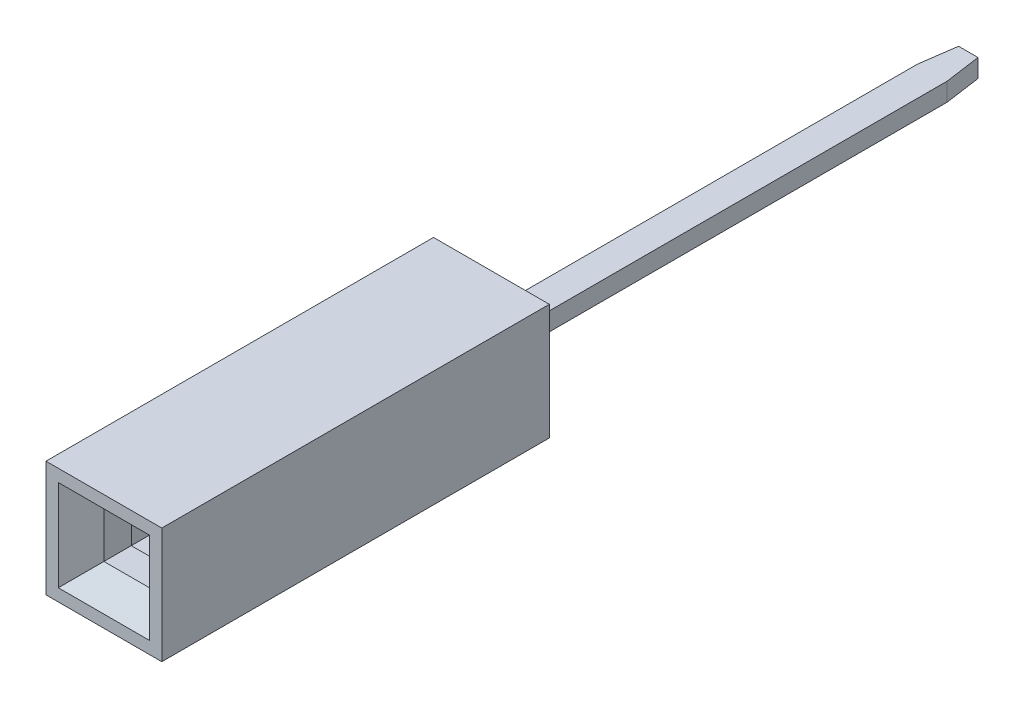
ISO-10303-21;
HEADER;
FILE_DESCRIPTION(('STEP AP214'),'2;1');
FILE_NAME('part.step','',(''),(''),'','','');
FILE_SCHEMA(('AUTOMOTIVE_DESIGN { 1 0 10303 214 1 1 1 1 }'));
ENDSEC;
DATA;
#1=APPLICATION_CONTEXT('core data for automotive mechanical design processes');
#2=APPLICATION_PROTOCOL_DEFINITION('international standard','automotive_design',2000,#1);
#3=PRODUCT_CONTEXT('',#1,'mechanical');
#4=PRODUCT('Part','Part','',(#3));
#5=PRODUCT_RELATED_PRODUCT_CATEGORY('part','',(#4));
#6=PRODUCT_DEFINITION_FORMATION('','',#4);
#7=PRODUCT_DEFINITION_CONTEXT('part definition',#1,'design');
#8=PRODUCT_DEFINITION('design','',#6,#7);
#9=PRODUCT_DEFINITION_SHAPE('','',#8);
#10=(LENGTH_UNIT() NAMED_UNIT(*) SI_UNIT(.MILLI.,.METRE.));
#11=(NAMED_UNIT(*) PLANE_ANGLE_UNIT() SI_UNIT($,.RADIAN.));
#12=(NAMED_UNIT(*) SI_UNIT($,.STERADIAN.) SOLID_ANGLE_UNIT());
#13=UNCERTAINTY_MEASURE_WITH_UNIT(LENGTH_MEASURE(1.E-05),#10,'distance_accuracy_value','');
#14=(GEOMETRIC_REPRESENTATION_CONTEXT(3) GLOBAL_UNCERTAINTY_ASSIGNED_CONTEXT((#13)) GLOBAL_UNIT_ASSIGNED_CONTEXT((#10,
#11,#12)) REPRESENTATION_CONTEXT('',''));
#15=CARTESIAN_POINT('',(0.,0.,0.));
#16=DIRECTION('',(0.,0.,1.));
#17=DIRECTION('',(1.,0.,0.));
#18=AXIS2_PLACEMENT_3D('',#15,#16,#17);
#19=CARTESIAN_POINT('',(0.,0.2,0.284306438184069));
#20=DIRECTION('',(0.,1.,0.));
#21=DIRECTION('',(-1.,0.,0.));
#22=AXIS2_PLACEMENT_3D('',#19,#20,#21);
#23=PLANE('',#22);
#24=DIRECTION('',(0.395545502562963,0.,0.918446381343088));
#25=VECTOR('',#24,1.);
#26=CARTESIAN_POINT('',(0.725635995876159,0.2,7.6218292408588));
#27=LINE('',#26,#25);
#28=CARTESIAN_POINT('',(0.850958820007971,0.2,7.91282558281629));
#29=VERTEX_POINT('',#28);
#30=CARTESIAN_POINT('',(0.600313171744347,0.2,7.33083289890131));
#31=VERTEX_POINT('',#30);
#32=EDGE_CURVE('P0_E245',#29,#31,#27,.F.);
#33=ORIENTED_EDGE('',*,*,#32,.F.);
#34=CARTESIAN_POINT('',(0.942803458142281,0.2,7.87327103255999));
#35=DIRECTION('',(0.,1.,0.));
#36=DIRECTION('',(0.,0.,1.));
#37=AXIS2_PLACEMENT_3D('',#34,#35,#36);
#38=CIRCLE('',#37,0.100000000000002);
#39=CARTESIAN_POINT('',(1.04280345814228,0.2,7.87327103255999));
#40=VERTEX_POINT('',#39);
#41=EDGE_CURVE('P0_E292',#40,#29,#38,.F.);
#42=ORIENTED_EDGE('',*,*,#41,.F.);
#43=DIRECTION('',(0.,0.,-1.));
#44=VECTOR('',#43,1.);
#45=CARTESIAN_POINT('',(1.04280345814228,0.2,4.38077744066125));
#46=LINE('',#45,#44);
#47=CARTESIAN_POINT('',(1.04280345814228,0.2,0.888283848762512));
#48=VERTEX_POINT('',#47);
#49=EDGE_CURVE('P0_E236',#48,#40,#46,.F.);
#50=ORIENTED_EDGE('',*,*,#49,.F.);
#51=DIRECTION('',(-1.,0.,0.));
#52=VECTOR('',#51,1.);
#53=CARTESIAN_POINT('',(0.,0.2,0.888283848762512));
#54=LINE('',#53,#52);
#55=CARTESIAN_POINT('',(0.324469626937749,0.2,0.888283848762512));
#56=VERTEX_POINT('',#55);
#57=EDGE_CURVE('P0_E233',#48,#56,#54,.T.);
#58=ORIENTED_EDGE('',*,*,#57,.T.);
#59=DIRECTION('',(0.,0.,-1.));
#60=VECTOR('',#59,1.);
#61=CARTESIAN_POINT('',(0.324469626937749,0.2,-4.39155100923728));
#62=LINE('',#61,#60);
#63=CARTESIAN_POINT('',(0.324469626937751,0.2,-9.67138586723707));
#64=VERTEX_POINT('',#63);
#65=EDGE_CURVE('P0_E230',#64,#56,#62,.F.);
#66=ORIENTED_EDGE('',*,*,#65,.F.);
#67=DIRECTION('',(-0.14003721977104,0.,-0.990146240248781));
#68=VECTOR('',#67,1.);
#69=CARTESIAN_POINT('',(0.268734813468875,0.2,-10.0654640708561));
#70=LINE('',#69,#68);
#71=CARTESIAN_POINT('',(0.213000000000001,0.2,-10.4595422744751));
#72=VERTEX_POINT('',#71);
#73=EDGE_CURVE('P0_E218',#72,#64,#70,.F.);
#74=ORIENTED_EDGE('',*,*,#73,.F.);
#75=DIRECTION('',(-1.,0.,0.));
#76=VECTOR('',#75,1.);
#77=CARTESIAN_POINT('',(0.1065,0.2,-10.4595422744751));
#78=LINE('',#77,#76);
#79=CARTESIAN_POINT('',(-0.213000000000003,0.2,-10.4595422744751));
#80=VERTEX_POINT('',#79);
#81=EDGE_CURVE('P0_E208',#80,#72,#78,.F.);
#82=ORIENTED_EDGE('',*,*,#81,.F.);
#83=DIRECTION('',(-0.14003721977104,0.,0.990146240248781));
#84=VECTOR('',#83,1.);
#85=CARTESIAN_POINT('',(-0.268734813468875,0.2,-10.0654640708561));
#86=LINE('',#85,#84);
#87=CARTESIAN_POINT('',(-0.32446962693775,0.2,-9.67138586723707));
#88=VERTEX_POINT('',#87);
#89=EDGE_CURVE('P0_E198',#88,#80,#86,.F.);
#90=ORIENTED_EDGE('',*,*,#89,.F.);
#91=DIRECTION('',(0.,0.,1.));
#92=VECTOR('',#91,1.);
#93=CARTESIAN_POINT('',(-0.324469626937749,0.2,-4.39155100923728));
#94=LINE('',#93,#92);
#95=CARTESIAN_POINT('',(-0.324469626937749,0.2,0.888283848762512));
#96=VERTEX_POINT('',#95);
#97=EDGE_CURVE('P0_E188',#96,#88,#94,.F.);
#98=ORIENTED_EDGE('',*,*,#97,.F.);
#99=DIRECTION('',(-1.,0.,0.));
#100=VECTOR('',#99,1.);
#101=CARTESIAN_POINT('',(-0.683636542540015,0.2,0.888283848762512));
#102=LINE('',#101,#100);
#103=CARTESIAN_POINT('',(-1.04280345814228,0.2,0.888283848762512));
#104=VERTEX_POINT('',#103);
#105=EDGE_CURVE('P0_E155',#104,#96,#102,.F.);
#106=ORIENTED_EDGE('',*,*,#105,.F.);
#107=DIRECTION('',(0.,0.,1.));
#108=VECTOR('',#107,1.);
#109=CARTESIAN_POINT('',(-1.04280345814228,0.2,4.38077744066125));
#110=LINE('',#109,#108);
#111=CARTESIAN_POINT('',(-1.04280345814228,0.2,7.87327103255999));
#112=VERTEX_POINT('',#111);
#113=EDGE_CURVE('P0_E152',#112,#104,#110,.F.);
#114=ORIENTED_EDGE('',*,*,#113,.F.);
#115=CARTESIAN_POINT('',(-0.942803458142281,0.2,7.87327103255999));
#116=DIRECTION('',(0.,1.,0.));
#117=DIRECTION('',(0.,0.,1.));
#118=AXIS2_PLACEMENT_3D('',#115,#116,#117);
#119=CIRCLE('',#118,0.099999999999999);
#120=CARTESIAN_POINT('',(-0.850958820007972,0.2,7.91282558281629));
#121=VERTEX_POINT('',#120);
#122=EDGE_CURVE('P0_E20',#121,#112,#119,.F.);
#123=ORIENTED_EDGE('',*,*,#122,.F.);
#124=DIRECTION('',(0.395545502562963,0.,-0.918446381343088));
#125=VECTOR('',#124,1.);
#126=CARTESIAN_POINT('',(-0.72563599587616,0.2,7.6218292408588));
#127=LINE('',#126,#125);
#128=CARTESIAN_POINT('',(-0.600313171744342,0.2,7.3308328989013));
#129=VERTEX_POINT('',#128);
#130=EDGE_CURVE('P0_E137',#129,#121,#127,.F.);
#131=ORIENTED_EDGE('',*,*,#130,.F.);
#132=CARTESIAN_POINT('',(-2.98279491669871,0.2,6.42995974435727));
#133=DIRECTION('',(0.,1.,0.));
#134=DIRECTION('',(0.,0.,1.));
#135=AXIS2_PLACEMENT_3D('',#132,#133,#134);
#136=CIRCLE('',#135,2.54711438801223);
#137=CARTESIAN_POINT('',(-0.600313171744347,0.2,5.52908658981323));
#138=VERTEX_POINT('',#137);
#139=EDGE_CURVE('P0_E298',#138,#129,#136,.F.);
#140=ORIENTED_EDGE('',*,*,#139,.F.);
#141=DIRECTION('',(0.,0.,-1.));
#142=VECTOR('',#141,1.);
#143=CARTESIAN_POINT('',(-0.600313171744347,0.2,4.10337653011083));
#144=LINE('',#143,#142);
#145=CARTESIAN_POINT('',(-0.600313171744348,0.2,2.67766647040844));
#146=VERTEX_POINT('',#145);
#147=EDGE_CURVE('P0_E253',#146,#138,#144,.F.);
#148=ORIENTED_EDGE('',*,*,#147,.F.);
#149=CARTESIAN_POINT('',(0.,0.2,2.67766647040844));
#150=DIRECTION('',(0.,1.,0.));
#151=DIRECTION('',(0.,0.,1.));
#152=AXIS2_PLACEMENT_3D('',#149,#150,#151);
#153=CIRCLE('',#152,0.60031317174435);
#154=CARTESIAN_POINT('',(0.600313171744347,0.2,2.67766647040844));
#155=VERTEX_POINT('',#154);
#156=EDGE_CURVE('P0_E252',#146,#155,#153,.F.);
#157=ORIENTED_EDGE('',*,*,#156,.T.);
#158=DIRECTION('',(0.,0.,1.));
#159=VECTOR('',#158,1.);
#160=CARTESIAN_POINT('',(0.600313171744347,0.2,4.10337653011083));
#161=LINE('',#160,#159);
#162=CARTESIAN_POINT('',(0.600313171744347,0.2,5.52908658981323));
#163=VERTEX_POINT('',#162);
#164=EDGE_CURVE('P0_E249',#163,#155,#161,.F.);
#165=ORIENTED_EDGE('',*,*,#164,.F.);
#166=CARTESIAN_POINT('',(2.98279491669871,0.2,6.42995974435727));
#167=DIRECTION('',(0.,1.,0.));
#168=DIRECTION('',(0.,0.,1.));
#169=AXIS2_PLACEMENT_3D('',#166,#167,#168);
#170=CIRCLE('',#169,2.54711438801223);
#171=EDGE_CURVE('P0_E294',#31,#163,#170,.F.);
#172=ORIENTED_EDGE('',*,*,#171,.F.);
#173=EDGE_LOOP('',(#33,#42,#50,#58,#66,#74,#82,#90,#98,#106,#114,#123,#131,#140,#148,#157,#165,#172));
#174=FACE_BOUND('',#173,.T.);
#175=ADVANCED_FACE('P0_F17',(#174),#23,.T.);
#176=CARTESIAN_POINT('',(0.324469626937749,-0.2,-4.39155100923728));
#177=DIRECTION('',(1.,0.,0.));
#178=DIRECTION('',(0.,0.,-1.));
#179=AXIS2_PLACEMENT_3D('',#176,#177,#178);
#180=PLANE('',#179);
#181=DIRECTION('',(0.,0.,1.));
#182=VECTOR('',#181,1.);
#183=CARTESIAN_POINT('',(0.324469626937749,-0.2,0.284306438184069));
#184=LINE('',#183,#182);
#185=CARTESIAN_POINT('',(0.324469626937749,-0.2,0.888283848762512));
#186=VERTEX_POINT('',#185);
#187=CARTESIAN_POINT('',(0.324469626937757,-0.2,-9.67138586723696));
#188=VERTEX_POINT('',#187);
#189=EDGE_CURVE('P0_E213',#186,#188,#184,.F.);
#190=ORIENTED_EDGE('',*,*,#189,.T.);
#191=DIRECTION('',(0.,1.,0.));
#192=VECTOR('',#191,1.);
#193=CARTESIAN_POINT('',(0.324469626937751,-0.2,-9.67138586723707));
#194=LINE('',#193,#192);
#195=EDGE_CURVE('P0_E216',#64,#188,#194,.F.);
#196=ORIENTED_EDGE('',*,*,#195,.F.);
#197=ORIENTED_EDGE('',*,*,#65,.T.);
#198=DIRECTION('',(0.,1.,0.));
#199=VECTOR('',#198,1.);
#200=CARTESIAN_POINT('',(0.324469626937749,-0.2,0.888283848762512));
#201=LINE('',#200,#199);
#202=EDGE_CURVE('P0_E223',#186,#56,#201,.T.);
#203=ORIENTED_EDGE('',*,*,#202,.F.);
#204=EDGE_LOOP('',(#190,#196,#197,#203));
#205=FACE_BOUND('',#204,.T.);
#206=ADVANCED_FACE('P0_F403',(#205),#180,.T.);
#207=CARTESIAN_POINT('',(0.268734813468875,-0.2,-10.0654640708561));
#208=DIRECTION('',(0.990146240248781,0.,-0.14003721977104));
#209=DIRECTION('',(-0.14003721977104,0.,-0.990146240248781));
#210=AXIS2_PLACEMENT_3D('',#207,#208,#209);
#211=PLANE('',#210);
#212=DIRECTION('',(-0.140037219771042,0.,-0.990146240248781));
#213=VECTOR('',#212,1.);
#214=CARTESIAN_POINT('',(0.324469626937749,-0.2,-9.67138586723707));
#215=LINE('',#214,#213);
#216=CARTESIAN_POINT('',(0.213,-0.2,-10.4595422744751));
#217=VERTEX_POINT('',#216);
#218=EDGE_CURVE('P0_E203',#188,#217,#215,.T.);
#219=ORIENTED_EDGE('',*,*,#218,.T.);
#220=DIRECTION('',(0.,1.,0.));
#221=VECTOR('',#220,1.);
#222=CARTESIAN_POINT('',(0.213,-0.2,-10.4595422744751));
#223=LINE('',#222,#221);
#224=EDGE_CURVE('P0_E206',#72,#217,#223,.F.);
#225=ORIENTED_EDGE('',*,*,#224,.F.);
#226=ORIENTED_EDGE('',*,*,#73,.T.);
#227=ORIENTED_EDGE('',*,*,#195,.T.);
#228=EDGE_LOOP('',(#219,#225,#226,#227));
#229=FACE_BOUND('',#228,.T.);
#230=ADVANCED_FACE('P0_F409',(#229),#211,.T.);
#231=CARTESIAN_POINT('',(0.1065,-0.2,-10.4595422744751));
#232=DIRECTION('',(0.,0.,-1.));
#233=DIRECTION('',(-1.,0.,0.));
#234=AXIS2_PLACEMENT_3D('',#231,#232,#233);
#235=PLANE('',#234);
#236=DIRECTION('',(-1.,0.,0.));
#237=VECTOR('',#236,1.);
#238=CARTESIAN_POINT('',(0.,-0.2,-10.4595422744751));
#239=LINE('',#238,#237);
#240=CARTESIAN_POINT('',(-0.213000000000001,-0.2,-10.4595422744751));
#241=VERTEX_POINT('',#240);
#242=EDGE_CURVE('P0_E193',#217,#241,#239,.T.);
#243=ORIENTED_EDGE('',*,*,#242,.T.);
#244=DIRECTION('',(0.,1.,0.));
#245=VECTOR('',#244,1.);
#246=CARTESIAN_POINT('',(-0.213000000000003,-0.2,-10.4595422744751));
#247=LINE('',#246,#245);
#248=EDGE_CURVE('P0_E196',#80,#241,#247,.F.);
#249=ORIENTED_EDGE('',*,*,#248,.F.);
#250=ORIENTED_EDGE('',*,*,#81,.T.);
#251=ORIENTED_EDGE('',*,*,#224,.T.);
#252=EDGE_LOOP('',(#243,#249,#250,#251));
#253=FACE_BOUND('',#252,.T.);
#254=ADVANCED_FACE('P0_F415',(#253),#235,.T.);
#255=CARTESIAN_POINT('',(-0.268734813468875,-0.2,-10.0654640708561));
#256=DIRECTION('',(-0.990146240248781,0.,-0.14003721977104));
#257=DIRECTION('',(-0.14003721977104,0.,0.990146240248781));
#258=AXIS2_PLACEMENT_3D('',#255,#256,#257);
#259=PLANE('',#258);
#260=DIRECTION('',(-0.140037219771042,0.,0.990146240248781));
#261=VECTOR('',#260,1.);
#262=CARTESIAN_POINT('',(-0.213,-0.2,-10.4595422744751));
#263=LINE('',#262,#261);
#264=CARTESIAN_POINT('',(-0.324469626937747,-0.2,-9.67138586723709));
#265=VERTEX_POINT('',#264);
#266=EDGE_CURVE('P0_E183',#241,#265,#263,.T.);
#267=ORIENTED_EDGE('',*,*,#266,.T.);
#268=DIRECTION('',(0.,1.,0.));
#269=VECTOR('',#268,1.);
#270=CARTESIAN_POINT('',(-0.324469626937749,-0.2,-9.67138586723707));
#271=LINE('',#270,#269);
#272=EDGE_CURVE('P0_E186',#88,#265,#271,.F.);
#273=ORIENTED_EDGE('',*,*,#272,.F.);
#274=ORIENTED_EDGE('',*,*,#89,.T.);
#275=ORIENTED_EDGE('',*,*,#248,.T.);
#276=EDGE_LOOP('',(#267,#273,#274,#275));
#277=FACE_BOUND('',#276,.T.);
#278=ADVANCED_FACE('P0_F417',(#277),#259,.T.);
#279=CARTESIAN_POINT('',(-0.324469626937749,-0.2,-4.39155100923728));
#280=DIRECTION('',(-1.,0.,0.));
#281=DIRECTION('',(0.,0.,1.));
#282=AXIS2_PLACEMENT_3D('',#279,#280,#281);
#283=PLANE('',#282);
#284=DIRECTION('',(0.,0.,1.));
#285=VECTOR('',#284,1.);
#286=CARTESIAN_POINT('',(-0.324469626937749,-0.2,0.284306438184069));
#287=LINE('',#286,#285);
#288=CARTESIAN_POINT('',(-0.324469626937749,-0.2,0.888283848762512));
#289=VERTEX_POINT('',#288);
#290=EDGE_CURVE('P0_E175',#265,#289,#287,.T.);
#291=ORIENTED_EDGE('',*,*,#290,.T.);
#292=DIRECTION('',(0.,1.,0.));
#293=VECTOR('',#292,1.);
#294=CARTESIAN_POINT('',(-0.324469626937749,-0.2,0.888283848762512));
#295=LINE('',#294,#293);
#296=EDGE_CURVE('P0_E158',#96,#289,#295,.F.);
#297=ORIENTED_EDGE('',*,*,#296,.F.);
#298=ORIENTED_EDGE('',*,*,#97,.T.);
#299=ORIENTED_EDGE('',*,*,#272,.T.);
#300=EDGE_LOOP('',(#291,#297,#298,#299));
#301=FACE_BOUND('',#300,.T.);
#302=ADVANCED_FACE('P0_F422',(#301),#283,.T.);
#303=CARTESIAN_POINT('',(-0.683636542540015,-0.2,0.888283848762512));
#304=DIRECTION('',(0.,0.,-1.));
#305=DIRECTION('',(-1.,0.,0.));
#306=AXIS2_PLACEMENT_3D('',#303,#304,#305);
#307=PLANE('',#306);
#308=DIRECTION('',(-1.,0.,0.));
#309=VECTOR('',#308,1.);
#310=CARTESIAN_POINT('',(0.,-0.2,0.888283848762512));
#311=LINE('',#310,#309);
#312=CARTESIAN_POINT('',(-1.04280345814228,-0.2,0.888283848762512));
#313=VERTEX_POINT('',#312);
#314=EDGE_CURVE('P0_E172',#289,#313,#311,.T.);
#315=ORIENTED_EDGE('',*,*,#314,.T.);
#316=DIRECTION('',(0.,1.,0.));
#317=VECTOR('',#316,1.);
#318=CARTESIAN_POINT('',(-1.04280345814228,-0.2,0.888283848762512));
#319=LINE('',#318,#317);
#320=EDGE_CURVE('P0_E150',#104,#313,#319,.F.);
#321=ORIENTED_EDGE('',*,*,#320,.F.);
#322=ORIENTED_EDGE('',*,*,#105,.T.);
#323=ORIENTED_EDGE('',*,*,#296,.T.);
#324=EDGE_LOOP('',(#315,#321,#322,#323));
#325=FACE_BOUND('',#324,.T.);
#326=ADVANCED_FACE('P0_F424',(#325),#307,.T.);
#327=CARTESIAN_POINT('',(-1.04280345814228,-0.2,4.38077744066125));
#328=DIRECTION('',(-1.,0.,0.));
#329=DIRECTION('',(0.,0.,1.));
#330=AXIS2_PLACEMENT_3D('',#327,#328,#329);
#331=PLANE('',#330);
#332=DIRECTION('',(0.,0.,1.));
#333=VECTOR('',#332,1.);
#334=CARTESIAN_POINT('',(-1.04280345814228,-0.2,0.284306438184069));
#335=LINE('',#334,#333);
#336=CARTESIAN_POINT('',(-1.04280345814228,-0.2,7.87327103255999));
#337=VERTEX_POINT('',#336);
#338=EDGE_CURVE('P0_E163',#313,#337,#335,.T.);
#339=ORIENTED_EDGE('',*,*,#338,.T.);
#340=DIRECTION('',(0.,1.,0.));
#341=VECTOR('',#340,1.);
#342=CARTESIAN_POINT('',(-1.04280345814228,-0.2,7.87327103255999));
#343=LINE('',#342,#341);
#344=EDGE_CURVE('P0_E146',#112,#337,#343,.F.);
#345=ORIENTED_EDGE('',*,*,#344,.F.);
#346=ORIENTED_EDGE('',*,*,#113,.T.);
#347=ORIENTED_EDGE('',*,*,#320,.T.);
#348=EDGE_LOOP('',(#339,#345,#346,#347));
#349=FACE_BOUND('',#348,.T.);
#350=ADVANCED_FACE('P0_F161',(#349),#331,.T.);
#351=CARTESIAN_POINT('',(-0.942803458142281,-0.2,7.87327103255999));
#352=DIRECTION('',(0.,1.,0.));
#353=DIRECTION('',(0.,0.,1.));
#354=AXIS2_PLACEMENT_3D('',#351,#352,#353);
#355=CYLINDRICAL_SURFACE('',#354,0.099999999999999);
#356=CARTESIAN_POINT('',(-0.942803458142281,-0.2,7.87327103255999));
#357=DIRECTION('',(0.,1.,0.));
#358=DIRECTION('',(0.,0.,1.));
#359=AXIS2_PLACEMENT_3D('',#356,#357,#358);
#360=CIRCLE('',#359,0.099999999999999);
#361=CARTESIAN_POINT('',(-0.850958820007972,-0.2,7.91282558281629));
#362=VERTEX_POINT('',#361);
#363=EDGE_CURVE('P0_E290',#337,#362,#360,.T.);
#364=ORIENTED_EDGE('',*,*,#363,.T.);
#365=DIRECTION('',(0.,1.,0.));
#366=VECTOR('',#365,1.);
#367=CARTESIAN_POINT('',(-0.850958820007972,-0.2,7.91282558281629));
#368=LINE('',#367,#366);
#369=EDGE_CURVE('P0_E148',#121,#362,#368,.F.);
#370=ORIENTED_EDGE('',*,*,#369,.F.);
#371=ORIENTED_EDGE('',*,*,#122,.T.);
#372=ORIENTED_EDGE('',*,*,#344,.T.);
#373=EDGE_LOOP('',(#364,#370,#371,#372));
#374=FACE_BOUND('',#373,.T.);
#375=ADVANCED_FACE('P0_F144',(#374),#355,.T.);
#376=CARTESIAN_POINT('',(-0.72563599587616,-0.2,7.6218292408588));
#377=DIRECTION('',(0.918446381343088,0.,0.395545502562963));
#378=DIRECTION('',(0.395545502562963,0.,-0.918446381343088));
#379=AXIS2_PLACEMENT_3D('',#376,#377,#378);
#380=PLANE('',#379);
#381=DIRECTION('',(0.395545502562964,0.,-0.918446381343088));
#382=VECTOR('',#381,1.);
#383=CARTESIAN_POINT('',(-0.850958820007972,-0.2,7.91282558281629));
#384=LINE('',#383,#382);
#385=CARTESIAN_POINT('',(-0.600313171744348,-0.2,7.33083289890131));
#386=VERTEX_POINT('',#385);
#387=EDGE_CURVE('P0_E289',#362,#386,#384,.T.);
#388=ORIENTED_EDGE('',*,*,#387,.T.);
#389=DIRECTION('',(0.,1.,0.));
#390=VECTOR('',#389,1.);
#391=CARTESIAN_POINT('',(-0.600313171744347,-0.2,7.33083289890131));
#392=LINE('',#391,#390);
#393=EDGE_CURVE('P0_E255',#129,#386,#392,.F.);
#394=ORIENTED_EDGE('',*,*,#393,.F.);
#395=ORIENTED_EDGE('',*,*,#130,.T.);
#396=ORIENTED_EDGE('',*,*,#369,.T.);
#397=EDGE_LOOP('',(#388,#394,#395,#396));
#398=FACE_BOUND('',#397,.T.);
#399=ADVANCED_FACE('P0_F304',(#398),#380,.T.);
#400=CARTESIAN_POINT('',(-2.98279491669871,-0.2,6.42995974435727));
#401=DIRECTION('',(0.,1.,0.));
#402=DIRECTION('',(0.,0.,1.));
#403=AXIS2_PLACEMENT_3D('',#400,#401,#402);
#404=CYLINDRICAL_SURFACE('',#403,2.54711438801223);
#405=CARTESIAN_POINT('',(-2.98279491669871,-0.2,6.42995974435727));
#406=DIRECTION('',(0.,1.,0.));
#407=DIRECTION('',(0.,0.,1.));
#408=AXIS2_PLACEMENT_3D('',#405,#406,#407);
#409=CIRCLE('',#408,2.54711438801223);
#410=CARTESIAN_POINT('',(-0.600313171744347,-0.2,5.52908658981323));
#411=VERTEX_POINT('',#410);
#412=EDGE_CURVE('P0_E286',#386,#411,#409,.T.);
#413=ORIENTED_EDGE('',*,*,#412,.T.);
#414=DIRECTION('',(0.,1.,0.));
#415=VECTOR('',#414,1.);
#416=CARTESIAN_POINT('',(-0.600313171744347,-0.2,5.52908658981323));
#417=LINE('',#416,#415);
#418=EDGE_CURVE('P0_E254',#138,#411,#417,.F.);
#419=ORIENTED_EDGE('',*,*,#418,.F.);
#420=ORIENTED_EDGE('',*,*,#139,.T.);
#421=ORIENTED_EDGE('',*,*,#393,.T.);
#422=EDGE_LOOP('',(#413,#419,#420,#421));
#423=FACE_BOUND('',#422,.T.);
#424=ADVANCED_FACE('P0_F334',(#423),#404,.T.);
#425=CARTESIAN_POINT('',(-0.600313171744347,-0.2,4.10337653011083));
#426=DIRECTION('',(1.,0.,0.));
#427=DIRECTION('',(0.,0.,-1.));
#428=AXIS2_PLACEMENT_3D('',#425,#426,#427);
#429=PLANE('',#428);
#430=DIRECTION('',(0.,0.,1.));
#431=VECTOR('',#430,1.);
#432=CARTESIAN_POINT('',(-0.600313171744347,-0.2,0.284306438184069));
#433=LINE('',#432,#431);
#434=CARTESIAN_POINT('',(-0.600313171744348,-0.2,2.67766647040844));
#435=VERTEX_POINT('',#434);
#436=EDGE_CURVE('P0_E285',#411,#435,#433,.F.);
#437=ORIENTED_EDGE('',*,*,#436,.T.);
#438=DIRECTION('',(0.,1.,0.));
#439=VECTOR('',#438,1.);
#440=CARTESIAN_POINT('',(-0.60031317174435,-0.2,2.67766647040844));
#441=LINE('',#440,#439);
#442=EDGE_CURVE('P0_E297',#435,#146,#441,.T.);
#443=ORIENTED_EDGE('',*,*,#442,.T.);
#444=ORIENTED_EDGE('',*,*,#147,.T.);
#445=ORIENTED_EDGE('',*,*,#418,.T.);
#446=EDGE_LOOP('',(#437,#443,#444,#445));
#447=FACE_BOUND('',#446,.T.);
#448=ADVANCED_FACE('P0_F331',(#447),#429,.T.);
#449=CARTESIAN_POINT('',(0.,-0.2,2.67766647040844));
#450=DIRECTION('',(0.,1.,0.));
#451=DIRECTION('',(0.,0.,1.));
#452=AXIS2_PLACEMENT_3D('',#449,#450,#451);
#453=CYLINDRICAL_SURFACE('',#452,0.60031317174435);
#454=ORIENTED_EDGE('',*,*,#442,.F.);
#455=CARTESIAN_POINT('',(0.,-0.2,2.67766647040844));
#456=DIRECTION('',(0.,1.,0.));
#457=DIRECTION('',(0.,0.,1.));
#458=AXIS2_PLACEMENT_3D('',#455,#456,#457);
#459=CIRCLE('',#458,0.60031317174435);
#460=CARTESIAN_POINT('',(0.600313171744347,-0.2,2.67766647040844));
#461=VERTEX_POINT('',#460);
#462=EDGE_CURVE('P0_E282',#435,#461,#459,.F.);
#463=ORIENTED_EDGE('',*,*,#462,.T.);
#464=DIRECTION('',(0.,1.,0.));
#465=VECTOR('',#464,1.);
#466=CARTESIAN_POINT('',(0.600313171744347,-0.2,2.67766647040844));
#467=LINE('',#466,#465);
#468=EDGE_CURVE('P0_E251',#155,#461,#467,.F.);
#469=ORIENTED_EDGE('',*,*,#468,.F.);
#470=ORIENTED_EDGE('',*,*,#156,.F.);
#471=EDGE_LOOP('',(#454,#463,#469,#470));
#472=FACE_BOUND('',#471,.T.);
#473=ADVANCED_FACE('P0_F342',(#472),#453,.F.);
#474=CARTESIAN_POINT('',(0.600313171744347,-0.2,4.10337653011083));
#475=DIRECTION('',(-1.,0.,0.));
#476=DIRECTION('',(0.,0.,1.));
#477=AXIS2_PLACEMENT_3D('',#474,#475,#476);
#478=PLANE('',#477);
#479=DIRECTION('',(0.,0.,1.));
#480=VECTOR('',#479,1.);
#481=CARTESIAN_POINT('',(0.600313171744347,-0.2,0.284306438184069));
#482=LINE('',#481,#480);
#483=CARTESIAN_POINT('',(0.600313171744347,-0.2,5.52908658981323));
#484=VERTEX_POINT('',#483);
#485=EDGE_CURVE('P0_E281',#461,#484,#482,.T.);
#486=ORIENTED_EDGE('',*,*,#485,.T.);
#487=DIRECTION('',(0.,1.,0.));
#488=VECTOR('',#487,1.);
#489=CARTESIAN_POINT('',(0.600313171744347,-0.2,5.52908658981323));
#490=LINE('',#489,#488);
#491=EDGE_CURVE('P0_E248',#163,#484,#490,.F.);
#492=ORIENTED_EDGE('',*,*,#491,.F.);
#493=ORIENTED_EDGE('',*,*,#164,.T.);
#494=ORIENTED_EDGE('',*,*,#468,.T.);
#495=EDGE_LOOP('',(#486,#492,#493,#494));
#496=FACE_BOUND('',#495,.T.);
#497=ADVANCED_FACE('P0_F368',(#496),#478,.T.);
#498=CARTESIAN_POINT('',(2.98279491669871,-0.2,6.42995974435727));
#499=DIRECTION('',(0.,1.,0.));
#500=DIRECTION('',(0.,0.,1.));
#501=AXIS2_PLACEMENT_3D('',#498,#499,#500);
#502=CYLINDRICAL_SURFACE('',#501,2.54711438801223);
#503=CARTESIAN_POINT('',(2.98279491669871,-0.2,6.42995974435727));
#504=DIRECTION('',(0.,1.,0.));
#505=DIRECTION('',(0.,0.,1.));
#506=AXIS2_PLACEMENT_3D('',#503,#504,#505);
#507=CIRCLE('',#506,2.54711438801223);
#508=CARTESIAN_POINT('',(0.600313171744346,-0.2,7.33083289890131));
#509=VERTEX_POINT('',#508);
#510=EDGE_CURVE('P0_E278',#484,#509,#507,.T.);
#511=ORIENTED_EDGE('',*,*,#510,.T.);
#512=DIRECTION('',(0.,1.,0.));
#513=VECTOR('',#512,1.);
#514=CARTESIAN_POINT('',(0.600313171744347,-0.2,7.33083289890131));
#515=LINE('',#514,#513);
#516=EDGE_CURVE('P0_E247',#31,#509,#515,.F.);
#517=ORIENTED_EDGE('',*,*,#516,.F.);
#518=ORIENTED_EDGE('',*,*,#171,.T.);
#519=ORIENTED_EDGE('',*,*,#491,.T.);
#520=EDGE_LOOP('',(#511,#517,#518,#519));
#521=FACE_BOUND('',#520,.T.);
#522=ADVANCED_FACE('P0_F364',(#521),#502,.T.);
#523=CARTESIAN_POINT('',(0.725635995876159,-0.2,7.6218292408588));
#524=DIRECTION('',(-0.918446381343088,0.,0.395545502562963));
#525=DIRECTION('',(0.395545502562963,0.,0.918446381343088));
#526=AXIS2_PLACEMENT_3D('',#523,#524,#525);
#527=PLANE('',#526);
#528=DIRECTION('',(0.395545502562964,0.,0.918446381343088));
#529=VECTOR('',#528,1.);
#530=CARTESIAN_POINT('',(0.600313171744347,-0.2,7.33083289890131));
#531=LINE('',#530,#529);
#532=CARTESIAN_POINT('',(0.850958820007971,-0.2,7.91282558281629));
#533=VERTEX_POINT('',#532);
#534=EDGE_CURVE('P0_E277',#509,#533,#531,.T.);
#535=ORIENTED_EDGE('',*,*,#534,.T.);
#536=DIRECTION('',(0.,1.,0.));
#537=VECTOR('',#536,1.);
#538=CARTESIAN_POINT('',(0.850958820007971,-0.2,7.91282558281629));
#539=LINE('',#538,#537);
#540=EDGE_CURVE('P0_E239',#29,#533,#539,.F.);
#541=ORIENTED_EDGE('',*,*,#540,.F.);
#542=ORIENTED_EDGE('',*,*,#32,.T.);
#543=ORIENTED_EDGE('',*,*,#516,.T.);
#544=EDGE_LOOP('',(#535,#541,#542,#543));
#545=FACE_BOUND('',#544,.T.);
#546=ADVANCED_FACE('P0_F360',(#545),#527,.T.);
#547=CARTESIAN_POINT('',(0.942803458142281,-0.2,7.87327103255999));
#548=DIRECTION('',(0.,1.,0.));
#549=DIRECTION('',(0.,0.,1.));
#550=AXIS2_PLACEMENT_3D('',#547,#548,#549);
#551=CYLINDRICAL_SURFACE('',#550,0.100000000000002);
#552=CARTESIAN_POINT('',(0.942803458142281,-0.2,7.87327103255999));
#553=DIRECTION('',(0.,1.,0.));
#554=DIRECTION('',(0.,0.,1.));
#555=AXIS2_PLACEMENT_3D('',#552,#553,#554);
#556=CIRCLE('',#555,0.100000000000002);
#557=CARTESIAN_POINT('',(1.04280345814228,-0.2,7.87327103255999));
#558=VERTEX_POINT('',#557);
#559=EDGE_CURVE('P0_E274',#533,#558,#556,.T.);
#560=ORIENTED_EDGE('',*,*,#559,.T.);
#561=DIRECTION('',(0.,1.,0.));
#562=VECTOR('',#561,1.);
#563=CARTESIAN_POINT('',(1.04280345814228,-0.2,7.87327103255999));
#564=LINE('',#563,#562);
#565=EDGE_CURVE('P0_E238',#40,#558,#564,.F.);
#566=ORIENTED_EDGE('',*,*,#565,.F.);
#567=ORIENTED_EDGE('',*,*,#41,.T.);
#568=ORIENTED_EDGE('',*,*,#540,.T.);
#569=EDGE_LOOP('',(#560,#566,#567,#568));
#570=FACE_BOUND('',#569,.T.);
#571=ADVANCED_FACE('P0_F356',(#570),#551,.T.);
#572=CARTESIAN_POINT('',(1.04280345814228,-0.2,4.38077744066125));
#573=DIRECTION('',(1.,0.,0.));
#574=DIRECTION('',(0.,0.,-1.));
#575=AXIS2_PLACEMENT_3D('',#572,#573,#574);
#576=PLANE('',#575);
#577=DIRECTION('',(0.,0.,1.));
#578=VECTOR('',#577,1.);
#579=CARTESIAN_POINT('',(1.04280345814228,-0.2,0.284306438184069));
#580=LINE('',#579,#578);
#581=CARTESIAN_POINT('',(1.04280345814228,-0.2,0.888283848762512));
#582=VERTEX_POINT('',#581);
#583=EDGE_CURVE('P0_E26',#558,#582,#580,.F.);
#584=ORIENTED_EDGE('',*,*,#583,.T.);
#585=DIRECTION('',(0.,1.,0.));
#586=VECTOR('',#585,1.);
#587=CARTESIAN_POINT('',(1.04280345814228,-0.2,0.888283848762512));
#588=LINE('',#587,#586);
#589=EDGE_CURVE('P0_E34',#48,#582,#588,.F.);
#590=ORIENTED_EDGE('',*,*,#589,.F.);
#591=ORIENTED_EDGE('',*,*,#49,.T.);
#592=ORIENTED_EDGE('',*,*,#565,.T.);
#593=EDGE_LOOP('',(#584,#590,#591,#592));
#594=FACE_BOUND('',#593,.T.);
#595=ADVANCED_FACE('P0_F351',(#594),#576,.T.);
#596=CARTESIAN_POINT('',(0.683636542540015,-0.2,0.888283848762512));
#597=DIRECTION('',(0.,0.,-1.));
#598=DIRECTION('',(-1.,0.,0.));
#599=AXIS2_PLACEMENT_3D('',#596,#597,#598);
#600=PLANE('',#599);
#601=DIRECTION('',(-1.,0.,0.));
#602=VECTOR('',#601,1.);
#603=CARTESIAN_POINT('',(0.,-0.2,0.888283848762512));
#604=LINE('',#603,#602);
#605=EDGE_CURVE('P0_E11',#582,#186,#604,.T.);
#606=ORIENTED_EDGE('',*,*,#605,.T.);
#607=ORIENTED_EDGE('',*,*,#202,.T.);
#608=ORIENTED_EDGE('',*,*,#57,.F.);
#609=ORIENTED_EDGE('',*,*,#589,.T.);
#610=EDGE_LOOP('',(#606,#607,#608,#609));
#611=FACE_BOUND('',#610,.T.);
#612=ADVANCED_FACE('P0_F346',(#611),#600,.T.);
#613=CARTESIAN_POINT('',(0.,-0.2,0.284306438184069));
#614=DIRECTION('',(0.,1.,0.));
#615=DIRECTION('',(-1.,0.,0.));
#616=AXIS2_PLACEMENT_3D('',#613,#614,#615);
#617=PLANE('',#616);
#618=ORIENTED_EDGE('',*,*,#583,.F.);
#619=ORIENTED_EDGE('',*,*,#559,.F.);
#620=ORIENTED_EDGE('',*,*,#534,.F.);
#621=ORIENTED_EDGE('',*,*,#510,.F.);
#622=ORIENTED_EDGE('',*,*,#485,.F.);
#623=ORIENTED_EDGE('',*,*,#462,.F.);
#624=ORIENTED_EDGE('',*,*,#436,.F.);
#625=ORIENTED_EDGE('',*,*,#412,.F.);
#626=ORIENTED_EDGE('',*,*,#387,.F.);
#627=ORIENTED_EDGE('',*,*,#363,.F.);
#628=ORIENTED_EDGE('',*,*,#338,.F.);
#629=ORIENTED_EDGE('',*,*,#314,.F.);
#630=ORIENTED_EDGE('',*,*,#290,.F.);
#631=ORIENTED_EDGE('',*,*,#266,.F.);
#632=ORIENTED_EDGE('',*,*,#242,.F.);
#633=ORIENTED_EDGE('',*,*,#218,.F.);
#634=ORIENTED_EDGE('',*,*,#189,.F.);
#635=ORIENTED_EDGE('',*,*,#605,.F.);
#636=EDGE_LOOP('',(#618,#619,#620,#621,#622,#623,#624,#625,#626,#627,#628,#629,#630,#631,#632,
#633,#634,#635));
#637=FACE_BOUND('',#636,.T.);
#638=ADVANCED_FACE('P0_F308',(#637),#617,.F.);
#639=CLOSED_SHELL('',(#175,#206,#230,#254,#278,#302,#326,#350,#375,#399,#424,#448,#473,#497,
#522,#546,#571,#595,#612,#638));
#640=MANIFOLD_SOLID_BREP('P0_B1',#639);
#641=CARTESIAN_POINT('',(0.,0.,7.4));
#642=DIRECTION('',(0.,0.,1.));
#643=DIRECTION('',(1.,0.,0.));
#644=AXIS2_PLACEMENT_3D('',#641,#642,#643);
#645=PLANE('',#644);
#646=DIRECTION('',(0.,1.,0.));
#647=VECTOR('',#646,1.);
#648=CARTESIAN_POINT('',(-1.,0.,7.4));
#649=LINE('',#648,#647);
#650=CARTESIAN_POINT('',(-1.,-1.,7.4));
#651=VERTEX_POINT('',#650);
#652=CARTESIAN_POINT('',(-1.,1.,7.4));
#653=VERTEX_POINT('',#652);
#654=EDGE_CURVE('P1_E144',#651,#653,#649,.T.);
#655=ORIENTED_EDGE('',*,*,#654,.T.);
#656=DIRECTION('',(1.,0.,0.));
#657=VECTOR('',#656,1.);
#658=CARTESIAN_POINT('',(0.,1.,7.4));
#659=LINE('',#658,#657);
#660=CARTESIAN_POINT('',(1.,1.,7.4));
#661=VERTEX_POINT('',#660);
#662=EDGE_CURVE('P1_E149',#653,#661,#659,.T.);
#663=ORIENTED_EDGE('',*,*,#662,.T.);
#664=DIRECTION('',(0.,1.,0.));
#665=VECTOR('',#664,1.);
#666=CARTESIAN_POINT('',(1.,0.,7.4));
#667=LINE('',#666,#665);
#668=CARTESIAN_POINT('',(1.,-1.,7.4));
#669=VERTEX_POINT('',#668);
#670=EDGE_CURVE('P1_E154',#661,#669,#667,.F.);
#671=ORIENTED_EDGE('',*,*,#670,.T.);
#672=DIRECTION('',(1.,0.,0.));
#673=VECTOR('',#672,1.);
#674=CARTESIAN_POINT('',(0.,-1.,7.4));
#675=LINE('',#674,#673);
#676=EDGE_CURVE('P1_E161',#669,#651,#675,.F.);
#677=ORIENTED_EDGE('',*,*,#676,.T.);
#678=EDGE_LOOP('',(#655,#663,#671,#677));
#679=FACE_BOUND('',#678,.T.);
#680=DIRECTION('',(1.,0.,0.));
#681=VECTOR('',#680,1.);
#682=CARTESIAN_POINT('',(0.,-0.5,7.4));
#683=LINE('',#682,#681);
#684=CARTESIAN_POINT('',(0.5,-0.5,7.4));
#685=VERTEX_POINT('',#684);
#686=CARTESIAN_POINT('',(-0.5,-0.5,7.4));
#687=VERTEX_POINT('',#686);
#688=EDGE_CURVE('P1_E141',#685,#687,#683,.F.);
#689=ORIENTED_EDGE('',*,*,#688,.F.);
#690=DIRECTION('',(0.,1.,0.));
#691=VECTOR('',#690,1.);
#692=CARTESIAN_POINT('',(0.5,0.,7.4));
#693=LINE('',#692,#691);
#694=CARTESIAN_POINT('',(0.5,0.5,7.4));
#695=VERTEX_POINT('',#694);
#696=EDGE_CURVE('P1_E127',#695,#685,#693,.F.);
#697=ORIENTED_EDGE('',*,*,#696,.F.);
#698=DIRECTION('',(1.,0.,0.));
#699=VECTOR('',#698,1.);
#700=CARTESIAN_POINT('',(0.,0.5,7.4));
#701=LINE('',#700,#699);
#702=CARTESIAN_POINT('',(-0.5,0.5,7.4));
#703=VERTEX_POINT('',#702);
#704=EDGE_CURVE('P1_E114',#703,#695,#701,.T.);
#705=ORIENTED_EDGE('',*,*,#704,.F.);
#706=DIRECTION('',(0.,1.,0.));
#707=VECTOR('',#706,1.);
#708=CARTESIAN_POINT('',(-0.5,0.,7.4));
#709=LINE('',#708,#707);
#710=EDGE_CURVE('P1_E19',#687,#703,#709,.T.);
#711=ORIENTED_EDGE('',*,*,#710,.F.);
#712=EDGE_LOOP('',(#689,#697,#705,#711));
#713=FACE_BOUND('',#712,.T.);
#714=ADVANCED_FACE('P1_F16',(#679,#713),#645,.F.);
#715=CARTESIAN_POINT('',(-0.5,0.,8.5));
#716=DIRECTION('',(1.,0.,0.));
#717=DIRECTION('',(0.,0.,-1.));
#718=AXIS2_PLACEMENT_3D('',#715,#716,#717);
#719=PLANE('',#718);
#720=ORIENTED_EDGE('',*,*,#710,.T.);
#721=DIRECTION('',(0.,0.,-1.));
#722=VECTOR('',#721,1.);
#723=CARTESIAN_POINT('',(-0.5,0.5,8.5));
#724=LINE('',#723,#722);
#725=CARTESIAN_POINT('',(-0.5,0.5,8.));
#726=VERTEX_POINT('',#725);
#727=EDGE_CURVE('P1_E120',#726,#703,#724,.T.);
#728=ORIENTED_EDGE('',*,*,#727,.F.);
#729=DIRECTION('',(0.,1.,0.));
#730=VECTOR('',#729,1.);
#731=CARTESIAN_POINT('',(-0.499999999999999,0.,8.));
#732=LINE('',#731,#730);
#733=CARTESIAN_POINT('',(-0.5,-0.5,8.));
#734=VERTEX_POINT('',#733);
#735=EDGE_CURVE('P1_E164',#734,#726,#732,.T.);
#736=ORIENTED_EDGE('',*,*,#735,.F.);
#737=DIRECTION('',(0.,0.,1.));
#738=VECTOR('',#737,1.);
#739=CARTESIAN_POINT('',(-0.5,-0.5,8.5));
#740=LINE('',#739,#738);
#741=EDGE_CURVE('P1_E123',#687,#734,#740,.T.);
#742=ORIENTED_EDGE('',*,*,#741,.F.);
#743=EDGE_LOOP('',(#720,#728,#736,#742));
#744=FACE_BOUND('',#743,.T.);
#745=ADVANCED_FACE('P1_F119',(#744),#719,.T.);
#746=CARTESIAN_POINT('',(0.,0.5,8.5));
#747=DIRECTION('',(0.,-1.,0.));
#748=DIRECTION('',(0.,0.,-1.));
#749=AXIS2_PLACEMENT_3D('',#746,#747,#748);
#750=PLANE('',#749);
#751=ORIENTED_EDGE('',*,*,#704,.T.);
#752=DIRECTION('',(0.,0.,1.));
#753=VECTOR('',#752,1.);
#754=CARTESIAN_POINT('',(0.5,0.5,8.5));
#755=LINE('',#754,#753);
#756=CARTESIAN_POINT('',(0.5,0.5,8.));
#757=VERTEX_POINT('',#756);
#758=EDGE_CURVE('P1_E129',#757,#695,#755,.F.);
#759=ORIENTED_EDGE('',*,*,#758,.F.);
#760=DIRECTION('',(1.,0.,0.));
#761=VECTOR('',#760,1.);
#762=CARTESIAN_POINT('',(0.,0.499999999999999,8.));
#763=LINE('',#762,#761);
#764=EDGE_CURVE('P1_E133',#726,#757,#763,.T.);
#765=ORIENTED_EDGE('',*,*,#764,.F.);
#766=ORIENTED_EDGE('',*,*,#727,.T.);
#767=EDGE_LOOP('',(#751,#759,#765,#766));
#768=FACE_BOUND('',#767,.T.);
#769=ADVANCED_FACE('P1_F131',(#768),#750,.T.);
#770=CARTESIAN_POINT('',(0.5,0.,8.5));
#771=DIRECTION('',(-1.,0.,0.));
#772=DIRECTION('',(0.,0.,1.));
#773=AXIS2_PLACEMENT_3D('',#770,#771,#772);
#774=PLANE('',#773);
#775=ORIENTED_EDGE('',*,*,#696,.T.);
#776=DIRECTION('',(0.,0.,1.));
#777=VECTOR('',#776,1.);
#778=CARTESIAN_POINT('',(0.5,-0.5,8.5));
#779=LINE('',#778,#777);
#780=CARTESIAN_POINT('',(0.5,-0.5,8.));
#781=VERTEX_POINT('',#780);
#782=EDGE_CURVE('P1_E138',#781,#685,#779,.F.);
#783=ORIENTED_EDGE('',*,*,#782,.F.);
#784=DIRECTION('',(0.,1.,0.));
#785=VECTOR('',#784,1.);
#786=CARTESIAN_POINT('',(0.499999999999999,0.,8.));
#787=LINE('',#786,#785);
#788=EDGE_CURVE('P1_E170',#757,#781,#787,.F.);
#789=ORIENTED_EDGE('',*,*,#788,.F.);
#790=ORIENTED_EDGE('',*,*,#758,.T.);
#791=EDGE_LOOP('',(#775,#783,#789,#790));
#792=FACE_BOUND('',#791,.T.);
#793=ADVANCED_FACE('P1_F280',(#792),#774,.T.);
#794=CARTESIAN_POINT('',(0.,-0.5,8.5));
#795=DIRECTION('',(0.,1.,0.));
#796=DIRECTION('',(0.,0.,1.));
#797=AXIS2_PLACEMENT_3D('',#794,#795,#796);
#798=PLANE('',#797);
#799=ORIENTED_EDGE('',*,*,#688,.T.);
#800=ORIENTED_EDGE('',*,*,#741,.T.);
#801=DIRECTION('',(1.,0.,0.));
#802=VECTOR('',#801,1.);
#803=CARTESIAN_POINT('',(0.,-0.499999999999999,8.));
#804=LINE('',#803,#802);
#805=EDGE_CURVE('P1_E176',#781,#734,#804,.F.);
#806=ORIENTED_EDGE('',*,*,#805,.F.);
#807=ORIENTED_EDGE('',*,*,#782,.T.);
#808=EDGE_LOOP('',(#799,#800,#806,#807));
#809=FACE_BOUND('',#808,.T.);
#810=ADVANCED_FACE('P1_F272',(#809),#798,.T.);
#811=CARTESIAN_POINT('',(-1.,0.,0.));
#812=DIRECTION('',(-1.,0.,0.));
#813=DIRECTION('',(0.,0.,1.));
#814=AXIS2_PLACEMENT_3D('',#811,#812,#813);
#815=PLANE('',#814);
#816=DIRECTION('',(0.,0.,-1.));
#817=VECTOR('',#816,1.);
#818=CARTESIAN_POINT('',(-1.,-1.,0.));
#819=LINE('',#818,#817);
#820=CARTESIAN_POINT('',(-1.,-1.,0.));
#821=VERTEX_POINT('',#820);
#822=EDGE_CURVE('P1_E156',#651,#821,#819,.T.);
#823=ORIENTED_EDGE('',*,*,#822,.T.);
#824=DIRECTION('',(0.,1.,0.));
#825=VECTOR('',#824,1.);
#826=CARTESIAN_POINT('',(-1.,0.,0.));
#827=LINE('',#826,#825);
#828=CARTESIAN_POINT('',(-1.,1.,0.));
#829=VERTEX_POINT('',#828);
#830=EDGE_CURVE('P1_E185',#821,#829,#827,.T.);
#831=ORIENTED_EDGE('',*,*,#830,.T.);
#832=DIRECTION('',(0.,0.,1.));
#833=VECTOR('',#832,1.);
#834=CARTESIAN_POINT('',(-1.,1.,0.));
#835=LINE('',#834,#833);
#836=EDGE_CURVE('P1_E146',#829,#653,#835,.T.);
#837=ORIENTED_EDGE('',*,*,#836,.T.);
#838=ORIENTED_EDGE('',*,*,#654,.F.);
#839=EDGE_LOOP('',(#823,#831,#837,#838));
#840=FACE_BOUND('',#839,.T.);
#841=ADVANCED_FACE('P1_F270',(#840),#815,.F.);
#842=CARTESIAN_POINT('',(0.,1.,0.));
#843=DIRECTION('',(0.,1.,0.));
#844=DIRECTION('',(0.,0.,1.));
#845=AXIS2_PLACEMENT_3D('',#842,#843,#844);
#846=PLANE('',#845);
#847=ORIENTED_EDGE('',*,*,#836,.F.);
#848=DIRECTION('',(1.,0.,0.));
#849=VECTOR('',#848,1.);
#850=CARTESIAN_POINT('',(0.,1.,0.));
#851=LINE('',#850,#849);
#852=CARTESIAN_POINT('',(1.,1.,0.));
#853=VERTEX_POINT('',#852);
#854=EDGE_CURVE('P1_E187',#829,#853,#851,.T.);
#855=ORIENTED_EDGE('',*,*,#854,.T.);
#856=DIRECTION('',(0.,0.,-1.));
#857=VECTOR('',#856,1.);
#858=CARTESIAN_POINT('',(1.,1.,0.));
#859=LINE('',#858,#857);
#860=EDGE_CURVE('P1_E151',#853,#661,#859,.F.);
#861=ORIENTED_EDGE('',*,*,#860,.T.);
#862=ORIENTED_EDGE('',*,*,#662,.F.);
#863=EDGE_LOOP('',(#847,#855,#861,#862));
#864=FACE_BOUND('',#863,.T.);
#865=ADVANCED_FACE('P1_F268',(#864),#846,.F.);
#866=CARTESIAN_POINT('',(1.,0.,0.));
#867=DIRECTION('',(1.,0.,0.));
#868=DIRECTION('',(0.,0.,-1.));
#869=AXIS2_PLACEMENT_3D('',#866,#867,#868);
#870=PLANE('',#869);
#871=ORIENTED_EDGE('',*,*,#860,.F.);
#872=DIRECTION('',(0.,1.,0.));
#873=VECTOR('',#872,1.);
#874=CARTESIAN_POINT('',(1.,0.,0.));
#875=LINE('',#874,#873);
#876=CARTESIAN_POINT('',(1.,-1.,0.));
#877=VERTEX_POINT('',#876);
#878=EDGE_CURVE('P1_E189',#853,#877,#875,.F.);
#879=ORIENTED_EDGE('',*,*,#878,.T.);
#880=DIRECTION('',(0.,0.,-1.));
#881=VECTOR('',#880,1.);
#882=CARTESIAN_POINT('',(1.,-1.,0.));
#883=LINE('',#882,#881);
#884=EDGE_CURVE('P1_E158',#877,#669,#883,.F.);
#885=ORIENTED_EDGE('',*,*,#884,.T.);
#886=ORIENTED_EDGE('',*,*,#670,.F.);
#887=EDGE_LOOP('',(#871,#879,#885,#886));
#888=FACE_BOUND('',#887,.T.);
#889=ADVANCED_FACE('P1_F258',(#888),#870,.F.);
#890=CARTESIAN_POINT('',(0.,-1.,0.));
#891=DIRECTION('',(0.,-1.,0.));
#892=DIRECTION('',(0.,0.,-1.));
#893=AXIS2_PLACEMENT_3D('',#890,#891,#892);
#894=PLANE('',#893);
#895=ORIENTED_EDGE('',*,*,#884,.F.);
#896=DIRECTION('',(1.,0.,0.));
#897=VECTOR('',#896,1.);
#898=CARTESIAN_POINT('',(0.,-1.,0.));
#899=LINE('',#898,#897);
#900=EDGE_CURVE('P1_E191',#877,#821,#899,.F.);
#901=ORIENTED_EDGE('',*,*,#900,.T.);
#902=ORIENTED_EDGE('',*,*,#822,.F.);
#903=ORIENTED_EDGE('',*,*,#676,.F.);
#904=EDGE_LOOP('',(#895,#901,#902,#903));
#905=FACE_BOUND('',#904,.T.);
#906=ADVANCED_FACE('P1_F262',(#905),#894,.F.);
#907=CARTESIAN_POINT('',(-0.75,0.,8.25));
#908=DIRECTION('',(0.707106781186546,0.,0.707106781186549));
#909=DIRECTION('',(0.707106781186549,0.,-0.707106781186546));
#910=AXIS2_PLACEMENT_3D('',#907,#908,#909);
#911=PLANE('',#910);
#912=DIRECTION('',(0.,1.,0.));
#913=VECTOR('',#912,1.);
#914=CARTESIAN_POINT('',(-1.,0.,8.5));
#915=LINE('',#914,#913);
#916=CARTESIAN_POINT('',(-1.,-1.,8.5));
#917=VERTEX_POINT('',#916);
#918=CARTESIAN_POINT('',(-1.,1.,8.5));
#919=VERTEX_POINT('',#918);
#920=EDGE_CURVE('P1_E206',#917,#919,#915,.T.);
#921=ORIENTED_EDGE('',*,*,#920,.F.);
#922=DIRECTION('',(-0.577350269189625,-0.577350269189627,0.577350269189625));
#923=VECTOR('',#922,1.);
#924=CARTESIAN_POINT('',(-0.5,-0.499999999999999,8.));
#925=LINE('',#924,#923);
#926=EDGE_CURVE('P1_E179',#734,#917,#925,.T.);
#927=ORIENTED_EDGE('',*,*,#926,.F.);
#928=ORIENTED_EDGE('',*,*,#735,.T.);
#929=DIRECTION('',(0.577350269189625,-0.577350269189627,-0.577350269189625));
#930=VECTOR('',#929,1.);
#931=CARTESIAN_POINT('',(-1.,1.,8.5));
#932=LINE('',#931,#930);
#933=EDGE_CURVE('P1_E167',#919,#726,#932,.T.);
#934=ORIENTED_EDGE('',*,*,#933,.F.);
#935=EDGE_LOOP('',(#921,#927,#928,#934));
#936=FACE_BOUND('',#935,.T.);
#937=ADVANCED_FACE('P1_F308',(#936),#911,.T.);
#938=CARTESIAN_POINT('',(0.,0.75,8.25));
#939=DIRECTION('',(0.,-0.707106781186546,0.707106781186549));
#940=DIRECTION('',(0.,-0.707106781186549,-0.707106781186546));
#941=AXIS2_PLACEMENT_3D('',#938,#939,#940);
#942=PLANE('',#941);
#943=DIRECTION('',(1.,0.,0.));
#944=VECTOR('',#943,1.);
#945=CARTESIAN_POINT('',(0.,1.,8.5));
#946=LINE('',#945,#944);
#947=CARTESIAN_POINT('',(1.,1.,8.5));
#948=VERTEX_POINT('',#947);
#949=EDGE_CURVE('P1_E209',#919,#948,#946,.T.);
#950=ORIENTED_EDGE('',*,*,#949,.F.);
#951=ORIENTED_EDGE('',*,*,#933,.T.);
#952=ORIENTED_EDGE('',*,*,#764,.T.);
#953=DIRECTION('',(-0.577350269189627,-0.577350269189625,-0.577350269189625));
#954=VECTOR('',#953,1.);
#955=CARTESIAN_POINT('',(1.,1.,8.5));
#956=LINE('',#955,#954);
#957=EDGE_CURVE('P1_E173',#948,#757,#956,.T.);
#958=ORIENTED_EDGE('',*,*,#957,.F.);
#959=EDGE_LOOP('',(#950,#951,#952,#958));
#960=FACE_BOUND('',#959,.T.);
#961=ADVANCED_FACE('P1_F304',(#960),#942,.T.);
#962=CARTESIAN_POINT('',(0.75,0.,8.25));
#963=DIRECTION('',(-0.707106781186546,0.,0.707106781186549));
#964=DIRECTION('',(0.707106781186549,0.,0.707106781186546));
#965=AXIS2_PLACEMENT_3D('',#962,#963,#964);
#966=PLANE('',#965);
#967=DIRECTION('',(0.,1.,0.));
#968=VECTOR('',#967,1.);
#969=CARTESIAN_POINT('',(1.,0.,8.5));
#970=LINE('',#969,#968);
#971=CARTESIAN_POINT('',(1.,-1.,8.5));
#972=VERTEX_POINT('',#971);
#973=EDGE_CURVE('P1_E212',#948,#972,#970,.F.);
#974=ORIENTED_EDGE('',*,*,#973,.F.);
#975=ORIENTED_EDGE('',*,*,#957,.T.);
#976=ORIENTED_EDGE('',*,*,#788,.T.);
#977=DIRECTION('',(-0.577350269189625,0.577350269189627,-0.577350269189625));
#978=VECTOR('',#977,1.);
#979=CARTESIAN_POINT('',(1.,-1.,8.5));
#980=LINE('',#979,#978);
#981=EDGE_CURVE('P1_E182',#972,#781,#980,.T.);
#982=ORIENTED_EDGE('',*,*,#981,.F.);
#983=EDGE_LOOP('',(#974,#975,#976,#982));
#984=FACE_BOUND('',#983,.T.);
#985=ADVANCED_FACE('P1_F300',(#984),#966,.T.);
#986=CARTESIAN_POINT('',(0.,-0.75,8.25));
#987=DIRECTION('',(0.,0.707106781186546,0.707106781186549));
#988=DIRECTION('',(0.,-0.707106781186549,0.707106781186546));
#989=AXIS2_PLACEMENT_3D('',#986,#987,#988);
#990=PLANE('',#989);
#991=DIRECTION('',(1.,0.,0.));
#992=VECTOR('',#991,1.);
#993=CARTESIAN_POINT('',(0.,-1.,8.5));
#994=LINE('',#993,#992);
#995=EDGE_CURVE('P1_E215',#972,#917,#994,.F.);
#996=ORIENTED_EDGE('',*,*,#995,.F.);
#997=ORIENTED_EDGE('',*,*,#981,.T.);
#998=ORIENTED_EDGE('',*,*,#805,.T.);
#999=ORIENTED_EDGE('',*,*,#926,.T.);
#1000=EDGE_LOOP('',(#996,#997,#998,#999));
#1001=FACE_BOUND('',#1000,.T.);
#1002=ADVANCED_FACE('P1_F297',(#1001),#990,.T.);
#1003=CARTESIAN_POINT('',(1.27,0.,8.5));
#1004=DIRECTION('',(1.,0.,0.));
#1005=DIRECTION('',(0.,0.,-1.));
#1006=AXIS2_PLACEMENT_3D('',#1003,#1004,#1005);
#1007=PLANE('',#1006);
#1008=DIRECTION('',(0.,1.,0.));
#1009=VECTOR('',#1008,1.);
#1010=CARTESIAN_POINT('',(1.27,0.,8.5));
#1011=LINE('',#1010,#1009);
#1012=CARTESIAN_POINT('',(1.27,-1.27,8.5));
#1013=VERTEX_POINT('',#1012);
#1014=CARTESIAN_POINT('',(1.27,1.27,8.5));
#1015=VERTEX_POINT('',#1014);
#1016=EDGE_CURVE('P1_E204',#1013,#1015,#1011,.T.);
#1017=ORIENTED_EDGE('',*,*,#1016,.F.);
#1018=DIRECTION('',(0.,0.,-1.));
#1019=VECTOR('',#1018,1.);
#1020=CARTESIAN_POINT('',(1.27,-1.27,8.5));
#1021=LINE('',#1020,#1019);
#1022=CARTESIAN_POINT('',(1.27,-1.27,0.));
#1023=VERTEX_POINT('',#1022);
#1024=EDGE_CURVE('P1_E199',#1023,#1013,#1021,.F.);
#1025=ORIENTED_EDGE('',*,*,#1024,.F.);
#1026=DIRECTION('',(0.,1.,0.));
#1027=VECTOR('',#1026,1.);
#1028=CARTESIAN_POINT('',(1.27,0.,0.));
#1029=LINE('',#1028,#1027);
#1030=CARTESIAN_POINT('',(1.27,1.27,0.));
#1031=VERTEX_POINT('',#1030);
#1032=EDGE_CURVE('P1_E194',#1023,#1031,#1029,.T.);
#1033=ORIENTED_EDGE('',*,*,#1032,.T.);
#1034=DIRECTION('',(0.,0.,1.));
#1035=VECTOR('',#1034,1.);
#1036=CARTESIAN_POINT('',(1.27,1.27,8.5));
#1037=LINE('',#1036,#1035);
#1038=EDGE_CURVE('P1_E222',#1015,#1031,#1037,.F.);
#1039=ORIENTED_EDGE('',*,*,#1038,.F.);
#1040=EDGE_LOOP('',(#1017,#1025,#1033,#1039));
#1041=FACE_BOUND('',#1040,.T.);
#1042=ADVANCED_FACE('P1_F242',(#1041),#1007,.T.);
#1043=CARTESIAN_POINT('',(0.,0.,0.));
#1044=DIRECTION('',(0.,0.,1.));
#1045=DIRECTION('',(1.,0.,0.));
#1046=AXIS2_PLACEMENT_3D('',#1043,#1044,#1045);
#1047=PLANE('',#1046);
#1048=DIRECTION('',(0.,1.,0.));
#1049=VECTOR('',#1048,1.);
#1050=CARTESIAN_POINT('',(-1.27,0.,0.));
#1051=LINE('',#1050,#1049);
#1052=CARTESIAN_POINT('',(-1.27,1.27,0.));
#1053=VERTEX_POINT('',#1052);
#1054=CARTESIAN_POINT('',(-1.27,-1.27,0.));
#1055=VERTEX_POINT('',#1054);
#1056=EDGE_CURVE('P1_E225',#1053,#1055,#1051,.F.);
#1057=ORIENTED_EDGE('',*,*,#1056,.F.);
#1058=DIRECTION('',(1.,0.,0.));
#1059=VECTOR('',#1058,1.);
#1060=CARTESIAN_POINT('',(0.,1.27,0.));
#1061=LINE('',#1060,#1059);
#1062=EDGE_CURVE('P1_E218',#1031,#1053,#1061,.F.);
#1063=ORIENTED_EDGE('',*,*,#1062,.F.);
#1064=ORIENTED_EDGE('',*,*,#1032,.F.);
#1065=DIRECTION('',(1.,0.,0.));
#1066=VECTOR('',#1065,1.);
#1067=CARTESIAN_POINT('',(0.,-1.27,0.));
#1068=LINE('',#1067,#1066);
#1069=EDGE_CURVE('P1_E196',#1055,#1023,#1068,.T.);
#1070=ORIENTED_EDGE('',*,*,#1069,.F.);
#1071=EDGE_LOOP('',(#1057,#1063,#1064,#1070));
#1072=FACE_BOUND('',#1071,.T.);
#1073=ORIENTED_EDGE('',*,*,#878,.F.);
#1074=ORIENTED_EDGE('',*,*,#854,.F.);
#1075=ORIENTED_EDGE('',*,*,#830,.F.);
#1076=ORIENTED_EDGE('',*,*,#900,.F.);
#1077=EDGE_LOOP('',(#1073,#1074,#1075,#1076));
#1078=FACE_BOUND('',#1077,.T.);
#1079=ADVANCED_FACE('P1_F247',(#1072,#1078),#1047,.F.);
#1080=CARTESIAN_POINT('',(0.,-1.27,8.5));
#1081=DIRECTION('',(0.,-1.,0.));
#1082=DIRECTION('',(0.,0.,-1.));
#1083=AXIS2_PLACEMENT_3D('',#1080,#1081,#1082);
#1084=PLANE('',#1083);
#1085=DIRECTION('',(1.,0.,0.));
#1086=VECTOR('',#1085,1.);
#1087=CARTESIAN_POINT('',(0.,-1.27,8.5));
#1088=LINE('',#1087,#1086);
#1089=CARTESIAN_POINT('',(-1.27,-1.27,8.5));
#1090=VERTEX_POINT('',#1089);
#1091=EDGE_CURVE('P1_E201',#1090,#1013,#1088,.T.);
#1092=ORIENTED_EDGE('',*,*,#1091,.F.);
#1093=DIRECTION('',(0.,0.,1.));
#1094=VECTOR('',#1093,1.);
#1095=CARTESIAN_POINT('',(-1.27,-1.27,8.5));
#1096=LINE('',#1095,#1094);
#1097=EDGE_CURVE('P1_E228',#1055,#1090,#1096,.T.);
#1098=ORIENTED_EDGE('',*,*,#1097,.F.);
#1099=ORIENTED_EDGE('',*,*,#1069,.T.);
#1100=ORIENTED_EDGE('',*,*,#1024,.T.);
#1101=EDGE_LOOP('',(#1092,#1098,#1099,#1100));
#1102=FACE_BOUND('',#1101,.T.);
#1103=ADVANCED_FACE('P1_F239',(#1102),#1084,.T.);
#1104=CARTESIAN_POINT('',(0.,0.,8.5));
#1105=DIRECTION('',(0.,0.,1.));
#1106=DIRECTION('',(1.,0.,0.));
#1107=AXIS2_PLACEMENT_3D('',#1104,#1105,#1106);
#1108=PLANE('',#1107);
#1109=ORIENTED_EDGE('',*,*,#973,.T.);
#1110=ORIENTED_EDGE('',*,*,#995,.T.);
#1111=ORIENTED_EDGE('',*,*,#920,.T.);
#1112=ORIENTED_EDGE('',*,*,#949,.T.);
#1113=EDGE_LOOP('',(#1109,#1110,#1111,#1112));
#1114=FACE_BOUND('',#1113,.T.);
#1115=ORIENTED_EDGE('',*,*,#1016,.T.);
#1116=DIRECTION('',(1.,0.,0.));
#1117=VECTOR('',#1116,1.);
#1118=CARTESIAN_POINT('',(0.,1.27,8.5));
#1119=LINE('',#1118,#1117);
#1120=CARTESIAN_POINT('',(-1.27,1.27,8.5));
#1121=VERTEX_POINT('',#1120);
#1122=EDGE_CURVE('P1_E34',#1121,#1015,#1119,.T.);
#1123=ORIENTED_EDGE('',*,*,#1122,.F.);
#1124=DIRECTION('',(0.,1.,0.));
#1125=VECTOR('',#1124,1.);
#1126=CARTESIAN_POINT('',(-1.27,0.,8.5));
#1127=LINE('',#1126,#1125);
#1128=EDGE_CURVE('P1_E25',#1090,#1121,#1127,.T.);
#1129=ORIENTED_EDGE('',*,*,#1128,.F.);
#1130=ORIENTED_EDGE('',*,*,#1091,.T.);
#1131=EDGE_LOOP('',(#1115,#1123,#1129,#1130));
#1132=FACE_BOUND('',#1131,.T.);
#1133=ADVANCED_FACE('P1_F235',(#1114,#1132),#1108,.T.);
#1134=CARTESIAN_POINT('',(0.,1.27,8.5));
#1135=DIRECTION('',(0.,1.,0.));
#1136=DIRECTION('',(0.,0.,1.));
#1137=AXIS2_PLACEMENT_3D('',#1134,#1135,#1136);
#1138=PLANE('',#1137);
#1139=ORIENTED_EDGE('',*,*,#1122,.T.);
#1140=ORIENTED_EDGE('',*,*,#1038,.T.);
#1141=ORIENTED_EDGE('',*,*,#1062,.T.);
#1142=DIRECTION('',(0.,0.,1.));
#1143=VECTOR('',#1142,1.);
#1144=CARTESIAN_POINT('',(-1.27,1.27,8.5));
#1145=LINE('',#1144,#1143);
#1146=EDGE_CURVE('P1_E11',#1121,#1053,#1145,.F.);
#1147=ORIENTED_EDGE('',*,*,#1146,.F.);
#1148=EDGE_LOOP('',(#1139,#1140,#1141,#1147));
#1149=FACE_BOUND('',#1148,.T.);
#1150=ADVANCED_FACE('P1_F245',(#1149),#1138,.T.);
#1151=CARTESIAN_POINT('',(-1.27,0.,8.5));
#1152=DIRECTION('',(-1.,0.,0.));
#1153=DIRECTION('',(0.,0.,1.));
#1154=AXIS2_PLACEMENT_3D('',#1151,#1152,#1153);
#1155=PLANE('',#1154);
#1156=ORIENTED_EDGE('',*,*,#1128,.T.);
#1157=ORIENTED_EDGE('',*,*,#1146,.T.);
#1158=ORIENTED_EDGE('',*,*,#1056,.T.);
#1159=ORIENTED_EDGE('',*,*,#1097,.T.);
#1160=EDGE_LOOP('',(#1156,#1157,#1158,#1159));
#1161=FACE_BOUND('',#1160,.T.);
#1162=ADVANCED_FACE('P1_F233',(#1161),#1155,.T.);
#1163=CLOSED_SHELL('',(#714,#745,#769,#793,#810,#841,#865,#889,#906,#937,#961,#985,#1002,#1042,
#1079,#1103,#1133,#1150,#1162));
#1164=MANIFOLD_SOLID_BREP('P1_B1',#1163);
#1165=ADVANCED_BREP_SHAPE_REPRESENTATION('',(#18,#640,#1164),#14);
#1166=SHAPE_DEFINITION_REPRESENTATION(#9,#1165);
ENDSEC;
END-ISO-10303-21;
